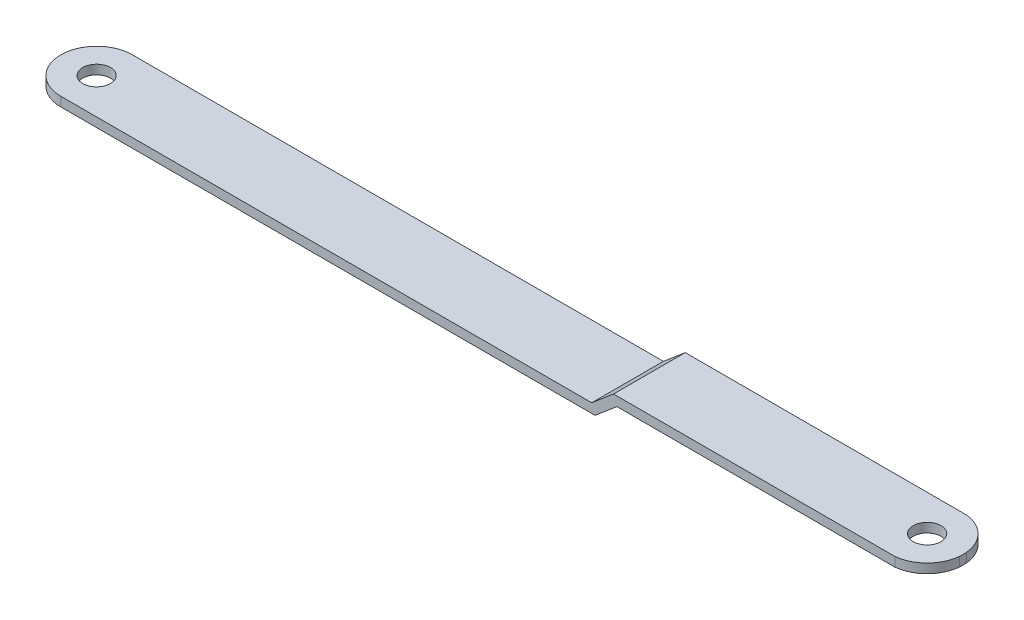
ISO-10303-21;
HEADER;
FILE_DESCRIPTION(('STEP AP214'),'2;1');
FILE_NAME('part.step','',(''),(''),'','','');
FILE_SCHEMA(('AUTOMOTIVE_DESIGN { 1 0 10303 214 1 1 1 1 }'));
ENDSEC;
DATA;
#1=APPLICATION_CONTEXT('core data for automotive mechanical design processes');
#2=APPLICATION_PROTOCOL_DEFINITION('international standard','automotive_design',2000,#1);
#3=PRODUCT_CONTEXT('',#1,'mechanical');
#4=PRODUCT('Part','Part','',(#3));
#5=PRODUCT_RELATED_PRODUCT_CATEGORY('part','',(#4));
#6=PRODUCT_DEFINITION_FORMATION('','',#4);
#7=PRODUCT_DEFINITION_CONTEXT('part definition',#1,'design');
#8=PRODUCT_DEFINITION('design','',#6,#7);
#9=PRODUCT_DEFINITION_SHAPE('','',#8);
#10=(LENGTH_UNIT() NAMED_UNIT(*) SI_UNIT(.MILLI.,.METRE.));
#11=(NAMED_UNIT(*) PLANE_ANGLE_UNIT() SI_UNIT($,.RADIAN.));
#12=(NAMED_UNIT(*) SI_UNIT($,.STERADIAN.) SOLID_ANGLE_UNIT());
#13=UNCERTAINTY_MEASURE_WITH_UNIT(LENGTH_MEASURE(1.E-05),#10,'distance_accuracy_value','');
#14=(GEOMETRIC_REPRESENTATION_CONTEXT(3) GLOBAL_UNCERTAINTY_ASSIGNED_CONTEXT((#13)) GLOBAL_UNIT_ASSIGNED_CONTEXT((#10,
#11,#12)) REPRESENTATION_CONTEXT('',''));
#15=CARTESIAN_POINT('',(0.,0.,0.));
#16=DIRECTION('',(0.,0.,1.));
#17=DIRECTION('',(1.,0.,0.));
#18=AXIS2_PLACEMENT_3D('',#15,#16,#17);
#19=CARTESIAN_POINT('',(127.21941338225,2.,15.5));
#20=DIRECTION('',(0.,1.,0.));
#21=DIRECTION('',(0.,0.,1.));
#22=AXIS2_PLACEMENT_3D('',#19,#20,#21);
#23=PLANE('',#22);
#24=CARTESIAN_POINT('',(187.25,2.,7.75));
#25=DIRECTION('',(0.,1.,0.));
#26=DIRECTION('',(0.,0.,1.));
#27=AXIS2_PLACEMENT_3D('',#24,#25,#26);
#28=CIRCLE('',#27,2.99999999999999);
#29=CARTESIAN_POINT('',(187.25,2.,10.75));
#30=VERTEX_POINT('',#29);
#31=EDGE_CURVE('E147',#30,#30,#28,.T.);
#32=ORIENTED_EDGE('',*,*,#31,.T.);
#33=EDGE_LOOP('',(#32));
#34=FACE_BOUND('',#33,.T.);
#35=CARTESIAN_POINT('',(187.25,2.,7.75));
#36=DIRECTION('',(0.,1.,0.));
#37=DIRECTION('',(0.,0.,1.));
#38=AXIS2_PLACEMENT_3D('',#35,#36,#37);
#39=CIRCLE('',#38,7.7884174595187);
#40=CARTESIAN_POINT('',(188.022623144706,2.,15.5));
#41=VERTEX_POINT('',#40);
#42=CARTESIAN_POINT('',(195.,2.,8.52262314470612));
#43=VERTEX_POINT('',#42);
#44=EDGE_CURVE('E227',#41,#43,#39,.T.);
#45=ORIENTED_EDGE('',*,*,#44,.F.);
#46=DIRECTION('',(1.,0.,0.));
#47=VECTOR('',#46,1.);
#48=CARTESIAN_POINT('',(127.21941338225,2.,15.5));
#49=LINE('',#48,#47);
#50=CARTESIAN_POINT('',(127.952959941045,2.,15.5));
#51=VERTEX_POINT('',#50);
#52=EDGE_CURVE('E159',#51,#41,#49,.T.);
#53=ORIENTED_EDGE('',*,*,#52,.F.);
#54=DIRECTION('',(0.,0.,-1.));
#55=VECTOR('',#54,1.);
#56=CARTESIAN_POINT('',(127.952959941045,2.,15.5));
#57=LINE('',#56,#55);
#58=CARTESIAN_POINT('',(127.952959941045,2.,0.));
#59=VERTEX_POINT('',#58);
#60=EDGE_CURVE('E160',#51,#59,#57,.T.);
#61=ORIENTED_EDGE('',*,*,#60,.T.);
#62=DIRECTION('',(1.,0.,0.));
#63=VECTOR('',#62,1.);
#64=CARTESIAN_POINT('',(127.21941338225,2.,0.));
#65=LINE('',#64,#63);
#66=CARTESIAN_POINT('',(188.022623144706,2.,0.));
#67=VERTEX_POINT('',#66);
#68=EDGE_CURVE('E141',#59,#67,#65,.T.);
#69=ORIENTED_EDGE('',*,*,#68,.T.);
#70=CARTESIAN_POINT('',(195.,2.,6.97737685529388));
#71=VERTEX_POINT('',#70);
#72=EDGE_CURVE('E121',#71,#67,#39,.T.);
#73=ORIENTED_EDGE('',*,*,#72,.F.);
#74=DIRECTION('',(0.,0.,-1.));
#75=VECTOR('',#74,1.);
#76=CARTESIAN_POINT('',(195.,2.,15.5));
#77=LINE('',#76,#75);
#78=EDGE_CURVE('E178',#43,#71,#77,.T.);
#79=ORIENTED_EDGE('',*,*,#78,.F.);
#80=EDGE_LOOP('',(#45,#53,#61,#69,#73,#79));
#81=FACE_BOUND('',#80,.T.);
#82=ADVANCED_FACE('F40',(#34,#81),#23,.F.);
#83=CARTESIAN_POINT('',(195.,4.,15.5));
#84=DIRECTION('',(1.,0.,0.));
#85=DIRECTION('',(0.,0.,-1.));
#86=AXIS2_PLACEMENT_3D('',#83,#84,#85);
#87=PLANE('',#86);
#88=ORIENTED_EDGE('',*,*,#78,.T.);
#89=DIRECTION('',(0.,1.,0.));
#90=VECTOR('',#89,1.);
#91=CARTESIAN_POINT('',(195.,-6.,6.97737685529388));
#92=LINE('',#91,#90);
#93=CARTESIAN_POINT('',(195.,4.,6.97737685529388));
#94=VERTEX_POINT('',#93);
#95=EDGE_CURVE('E230',#71,#94,#92,.T.);
#96=ORIENTED_EDGE('',*,*,#95,.T.);
#97=DIRECTION('',(0.,0.,-1.));
#98=VECTOR('',#97,1.);
#99=CARTESIAN_POINT('',(195.,4.,15.5));
#100=LINE('',#99,#98);
#101=CARTESIAN_POINT('',(195.,4.,8.52262314470612));
#102=VERTEX_POINT('',#101);
#103=EDGE_CURVE('E134',#102,#94,#100,.T.);
#104=ORIENTED_EDGE('',*,*,#103,.F.);
#105=DIRECTION('',(0.,1.,0.));
#106=VECTOR('',#105,1.);
#107=CARTESIAN_POINT('',(195.,-6.,8.52262314470612));
#108=LINE('',#107,#106);
#109=EDGE_CURVE('E231',#102,#43,#108,.F.);
#110=ORIENTED_EDGE('',*,*,#109,.T.);
#111=EDGE_LOOP('',(#88,#96,#104,#110));
#112=FACE_BOUND('',#111,.T.);
#113=ADVANCED_FACE('F266',(#112),#87,.T.);
#114=CARTESIAN_POINT('',(127.21941338225,4.,15.5));
#115=DIRECTION('',(0.,1.,0.));
#116=DIRECTION('',(0.,0.,1.));
#117=AXIS2_PLACEMENT_3D('',#114,#115,#116);
#118=PLANE('',#117);
#119=CARTESIAN_POINT('',(187.25,4.,7.75));
#120=DIRECTION('',(0.,1.,0.));
#121=DIRECTION('',(0.,0.,1.));
#122=AXIS2_PLACEMENT_3D('',#119,#120,#121);
#123=CIRCLE('',#122,2.99999999999999);
#124=CARTESIAN_POINT('',(187.25,4.,10.75));
#125=VERTEX_POINT('',#124);
#126=EDGE_CURVE('E376',#125,#125,#123,.T.);
#127=ORIENTED_EDGE('',*,*,#126,.F.);
#128=EDGE_LOOP('',(#127));
#129=FACE_BOUND('',#128,.T.);
#130=DIRECTION('',(1.,0.,0.));
#131=VECTOR('',#130,1.);
#132=CARTESIAN_POINT('',(127.21941338225,4.,15.5));
#133=LINE('',#132,#131);
#134=CARTESIAN_POINT('',(127.21941338225,4.,15.5));
#135=VERTEX_POINT('',#134);
#136=CARTESIAN_POINT('',(188.022623144706,4.,15.5));
#137=VERTEX_POINT('',#136);
#138=EDGE_CURVE('E198',#135,#137,#133,.T.);
#139=ORIENTED_EDGE('',*,*,#138,.T.);
#140=CARTESIAN_POINT('',(187.25,4.,7.75));
#141=DIRECTION('',(0.,1.,0.));
#142=DIRECTION('',(0.,0.,-1.));
#143=AXIS2_PLACEMENT_3D('',#140,#141,#142);
#144=CIRCLE('',#143,7.7884174595187);
#145=EDGE_CURVE('E56',#137,#102,#144,.T.);
#146=ORIENTED_EDGE('',*,*,#145,.T.);
#147=ORIENTED_EDGE('',*,*,#103,.T.);
#148=CARTESIAN_POINT('',(188.022623144706,4.,0.));
#149=VERTEX_POINT('',#148);
#150=EDGE_CURVE('E118',#94,#149,#144,.T.);
#151=ORIENTED_EDGE('',*,*,#150,.T.);
#152=DIRECTION('',(1.,0.,0.));
#153=VECTOR('',#152,1.);
#154=CARTESIAN_POINT('',(127.21941338225,4.,0.));
#155=LINE('',#154,#153);
#156=CARTESIAN_POINT('',(127.21941338225,4.,0.));
#157=VERTEX_POINT('',#156);
#158=EDGE_CURVE('E131',#157,#149,#155,.T.);
#159=ORIENTED_EDGE('',*,*,#158,.F.);
#160=DIRECTION('',(0.,0.,-1.));
#161=VECTOR('',#160,1.);
#162=CARTESIAN_POINT('',(127.21941338225,4.,15.5));
#163=LINE('',#162,#161);
#164=EDGE_CURVE('E173',#135,#157,#163,.T.);
#165=ORIENTED_EDGE('',*,*,#164,.F.);
#166=EDGE_LOOP('',(#139,#146,#147,#151,#159,#165));
#167=FACE_BOUND('',#166,.T.);
#168=ADVANCED_FACE('F130',(#129,#167),#118,.T.);
#169=CARTESIAN_POINT('',(0.,0.,15.5));
#170=DIRECTION('',(0.,1.,0.));
#171=DIRECTION('',(0.,0.,1.));
#172=AXIS2_PLACEMENT_3D('',#169,#170,#171);
#173=PLANE('',#172);
#174=CARTESIAN_POINT('',(7.75,0.,7.75));
#175=DIRECTION('',(0.,1.,0.));
#176=DIRECTION('',(0.,0.,1.));
#177=AXIS2_PLACEMENT_3D('',#174,#175,#176);
#178=CIRCLE('',#177,3.);
#179=CARTESIAN_POINT('',(7.75,0.,10.75));
#180=VERTEX_POINT('',#179);
#181=EDGE_CURVE('E240',#180,#180,#178,.T.);
#182=ORIENTED_EDGE('',*,*,#181,.F.);
#183=EDGE_LOOP('',(#182));
#184=FACE_BOUND('',#183,.T.);
#185=DIRECTION('',(1.,0.,0.));
#186=VECTOR('',#185,1.);
#187=CARTESIAN_POINT('',(0.,0.,0.));
#188=LINE('',#187,#186);
#189=CARTESIAN_POINT('',(7.75,0.,0.));
#190=VERTEX_POINT('',#189);
#191=CARTESIAN_POINT('',(122.5,0.,0.));
#192=VERTEX_POINT('',#191);
#193=EDGE_CURVE('E145',#190,#192,#188,.T.);
#194=ORIENTED_EDGE('',*,*,#193,.F.);
#195=CARTESIAN_POINT('',(7.75,0.,7.75));
#196=DIRECTION('',(0.,1.,0.));
#197=DIRECTION('',(0.,0.,1.));
#198=AXIS2_PLACEMENT_3D('',#195,#196,#197);
#199=CIRCLE('',#198,7.75);
#200=CARTESIAN_POINT('',(7.75,0.,15.5));
#201=VERTEX_POINT('',#200);
#202=EDGE_CURVE('E64',#190,#201,#199,.T.);
#203=ORIENTED_EDGE('',*,*,#202,.T.);
#204=DIRECTION('',(1.,0.,0.));
#205=VECTOR('',#204,1.);
#206=CARTESIAN_POINT('',(0.,0.,15.5));
#207=LINE('',#206,#205);
#208=CARTESIAN_POINT('',(122.5,0.,15.5));
#209=VERTEX_POINT('',#208);
#210=EDGE_CURVE('E191',#201,#209,#207,.T.);
#211=ORIENTED_EDGE('',*,*,#210,.T.);
#212=DIRECTION('',(0.,0.,-1.));
#213=VECTOR('',#212,1.);
#214=CARTESIAN_POINT('',(122.5,0.,15.5));
#215=LINE('',#214,#213);
#216=EDGE_CURVE('E169',#209,#192,#215,.T.);
#217=ORIENTED_EDGE('',*,*,#216,.T.);
#218=EDGE_LOOP('',(#194,#203,#211,#217));
#219=FACE_BOUND('',#218,.T.);
#220=ADVANCED_FACE('F188',(#184,#219),#173,.T.);
#221=CARTESIAN_POINT('',(0.,-2.,15.5));
#222=DIRECTION('',(0.,1.,0.));
#223=DIRECTION('',(0.,0.,1.));
#224=AXIS2_PLACEMENT_3D('',#221,#222,#223);
#225=PLANE('',#224);
#226=CARTESIAN_POINT('',(7.75,-2.,7.75));
#227=DIRECTION('',(0.,1.,0.));
#228=DIRECTION('',(0.,0.,1.));
#229=AXIS2_PLACEMENT_3D('',#226,#227,#228);
#230=CIRCLE('',#229,3.);
#231=CARTESIAN_POINT('',(7.75,-2.,10.75));
#232=VERTEX_POINT('',#231);
#233=EDGE_CURVE('E43',#232,#232,#230,.T.);
#234=ORIENTED_EDGE('',*,*,#233,.T.);
#235=EDGE_LOOP('',(#234));
#236=FACE_BOUND('',#235,.T.);
#237=CARTESIAN_POINT('',(7.75,-2.,7.75));
#238=DIRECTION('',(0.,1.,0.));
#239=DIRECTION('',(0.,0.,1.));
#240=AXIS2_PLACEMENT_3D('',#237,#238,#239);
#241=CIRCLE('',#240,7.75);
#242=CARTESIAN_POINT('',(7.75,-2.,0.));
#243=VERTEX_POINT('',#242);
#244=CARTESIAN_POINT('',(7.75,-2.,15.5));
#245=VERTEX_POINT('',#244);
#246=EDGE_CURVE('E374',#243,#245,#241,.T.);
#247=ORIENTED_EDGE('',*,*,#246,.F.);
#248=DIRECTION('',(1.,0.,0.));
#249=VECTOR('',#248,1.);
#250=CARTESIAN_POINT('',(0.,-2.,0.));
#251=LINE('',#250,#249);
#252=CARTESIAN_POINT('',(123.233546558795,-2.,0.));
#253=VERTEX_POINT('',#252);
#254=EDGE_CURVE('E153',#243,#253,#251,.T.);
#255=ORIENTED_EDGE('',*,*,#254,.T.);
#256=DIRECTION('',(0.,0.,-1.));
#257=VECTOR('',#256,1.);
#258=CARTESIAN_POINT('',(123.233546558795,-2.,15.5));
#259=LINE('',#258,#257);
#260=CARTESIAN_POINT('',(123.233546558795,-2.,15.5));
#261=VERTEX_POINT('',#260);
#262=EDGE_CURVE('E164',#261,#253,#259,.T.);
#263=ORIENTED_EDGE('',*,*,#262,.F.);
#264=DIRECTION('',(1.,0.,0.));
#265=VECTOR('',#264,1.);
#266=CARTESIAN_POINT('',(0.,-2.,15.5));
#267=LINE('',#266,#265);
#268=EDGE_CURVE('E213',#245,#261,#267,.T.);
#269=ORIENTED_EDGE('',*,*,#268,.F.);
#270=EDGE_LOOP('',(#247,#255,#263,#269));
#271=FACE_BOUND('',#270,.T.);
#272=ADVANCED_FACE('F281',(#236,#271),#225,.F.);
#273=CARTESIAN_POINT('',(0.,0.,15.5));
#274=DIRECTION('',(0.,0.,-1.));
#275=DIRECTION('',(-1.,0.,0.));
#276=AXIS2_PLACEMENT_3D('',#273,#274,#275);
#277=PLANE('',#276);
#278=DIRECTION('',(0.,1.,0.));
#279=VECTOR('',#278,1.);
#280=CARTESIAN_POINT('',(188.022623144706,-6.,15.5));
#281=LINE('',#280,#279);
#282=EDGE_CURVE('E202',#41,#137,#281,.T.);
#283=ORIENTED_EDGE('',*,*,#282,.T.);
#284=ORIENTED_EDGE('',*,*,#138,.F.);
#285=DIRECTION('',(0.762855964407713,0.646568463171209,0.));
#286=VECTOR('',#285,1.);
#287=CARTESIAN_POINT('',(122.5,0.,15.5));
#288=LINE('',#287,#286);
#289=EDGE_CURVE('E196',#209,#135,#288,.T.);
#290=ORIENTED_EDGE('',*,*,#289,.F.);
#291=ORIENTED_EDGE('',*,*,#210,.F.);
#292=DIRECTION('',(0.,1.,0.));
#293=VECTOR('',#292,1.);
#294=CARTESIAN_POINT('',(7.75,-6.,15.5));
#295=LINE('',#294,#293);
#296=EDGE_CURVE('E383',#245,#201,#295,.T.);
#297=ORIENTED_EDGE('',*,*,#296,.F.);
#298=ORIENTED_EDGE('',*,*,#268,.T.);
#299=DIRECTION('',(0.762855964407713,0.646568463171209,0.));
#300=VECTOR('',#299,1.);
#301=CARTESIAN_POINT('',(123.793136926342,-1.52571192881543,15.5));
#302=LINE('',#301,#300);
#303=EDGE_CURVE('E165',#261,#51,#302,.T.);
#304=ORIENTED_EDGE('',*,*,#303,.T.);
#305=ORIENTED_EDGE('',*,*,#52,.T.);
#306=EDGE_LOOP('',(#283,#284,#290,#291,#297,#298,#304,#305));
#307=FACE_BOUND('',#306,.T.);
#308=ADVANCED_FACE('F200',(#307),#277,.F.);
#309=CARTESIAN_POINT('',(0.,0.,0.));
#310=DIRECTION('',(0.,0.,-1.));
#311=DIRECTION('',(-1.,0.,0.));
#312=AXIS2_PLACEMENT_3D('',#309,#310,#311);
#313=PLANE('',#312);
#314=ORIENTED_EDGE('',*,*,#158,.T.);
#315=DIRECTION('',(0.,1.,0.));
#316=VECTOR('',#315,1.);
#317=CARTESIAN_POINT('',(188.022623144706,-6.,0.));
#318=LINE('',#317,#316);
#319=EDGE_CURVE('E12',#149,#67,#318,.F.);
#320=ORIENTED_EDGE('',*,*,#319,.T.);
#321=ORIENTED_EDGE('',*,*,#68,.F.);
#322=DIRECTION('',(0.762855964407713,0.646568463171209,0.));
#323=VECTOR('',#322,1.);
#324=CARTESIAN_POINT('',(123.793136926342,-1.52571192881543,0.));
#325=LINE('',#324,#323);
#326=EDGE_CURVE('E156',#253,#59,#325,.T.);
#327=ORIENTED_EDGE('',*,*,#326,.F.);
#328=ORIENTED_EDGE('',*,*,#254,.F.);
#329=DIRECTION('',(0.,1.,0.));
#330=VECTOR('',#329,1.);
#331=CARTESIAN_POINT('',(7.75,-6.,0.));
#332=LINE('',#331,#330);
#333=EDGE_CURVE('E49',#243,#190,#332,.T.);
#334=ORIENTED_EDGE('',*,*,#333,.T.);
#335=ORIENTED_EDGE('',*,*,#193,.T.);
#336=DIRECTION('',(0.762855964407713,0.646568463171209,0.));
#337=VECTOR('',#336,1.);
#338=CARTESIAN_POINT('',(122.5,0.,0.));
#339=LINE('',#338,#337);
#340=EDGE_CURVE('E139',#192,#157,#339,.T.);
#341=ORIENTED_EDGE('',*,*,#340,.T.);
#342=EDGE_LOOP('',(#314,#320,#321,#327,#328,#334,#335,#341));
#343=FACE_BOUND('',#342,.T.);
#344=ADVANCED_FACE('F137',(#343),#313,.T.);
#345=CARTESIAN_POINT('',(122.5,0.,15.5));
#346=DIRECTION('',(-0.646568463171209,0.762855964407713,0.));
#347=DIRECTION('',(-0.762855964407713,-0.646568463171209,0.));
#348=AXIS2_PLACEMENT_3D('',#345,#346,#347);
#349=PLANE('',#348);
#350=ORIENTED_EDGE('',*,*,#340,.F.);
#351=ORIENTED_EDGE('',*,*,#216,.F.);
#352=ORIENTED_EDGE('',*,*,#289,.T.);
#353=ORIENTED_EDGE('',*,*,#164,.T.);
#354=EDGE_LOOP('',(#350,#351,#352,#353));
#355=FACE_BOUND('',#354,.T.);
#356=ADVANCED_FACE('F195',(#355),#349,.T.);
#357=CARTESIAN_POINT('',(123.793136926342,-1.52571192881543,15.5));
#358=DIRECTION('',(-0.646568463171209,0.762855964407713,0.));
#359=DIRECTION('',(-0.762855964407713,-0.646568463171209,0.));
#360=AXIS2_PLACEMENT_3D('',#357,#358,#359);
#361=PLANE('',#360);
#362=ORIENTED_EDGE('',*,*,#326,.T.);
#363=ORIENTED_EDGE('',*,*,#60,.F.);
#364=ORIENTED_EDGE('',*,*,#303,.F.);
#365=ORIENTED_EDGE('',*,*,#262,.T.);
#366=EDGE_LOOP('',(#362,#363,#364,#365));
#367=FACE_BOUND('',#366,.T.);
#368=ADVANCED_FACE('F223',(#367),#361,.F.);
#369=CARTESIAN_POINT('',(7.75,-6.,7.75));
#370=DIRECTION('',(0.,1.,0.));
#371=DIRECTION('',(0.,0.,1.));
#372=AXIS2_PLACEMENT_3D('',#369,#370,#371);
#373=CYLINDRICAL_SURFACE('',#372,7.75);
#374=ORIENTED_EDGE('',*,*,#333,.F.);
#375=ORIENTED_EDGE('',*,*,#246,.T.);
#376=ORIENTED_EDGE('',*,*,#296,.T.);
#377=ORIENTED_EDGE('',*,*,#202,.F.);
#378=EDGE_LOOP('',(#374,#375,#376,#377));
#379=FACE_BOUND('',#378,.T.);
#380=ADVANCED_FACE('F287',(#379),#373,.T.);
#381=CARTESIAN_POINT('',(187.25,-6.,7.75));
#382=DIRECTION('',(0.,1.,0.));
#383=DIRECTION('',(0.,0.,1.));
#384=AXIS2_PLACEMENT_3D('',#381,#382,#383);
#385=CYLINDRICAL_SURFACE('',#384,7.7884174595187);
#386=ORIENTED_EDGE('',*,*,#72,.T.);
#387=ORIENTED_EDGE('',*,*,#319,.F.);
#388=ORIENTED_EDGE('',*,*,#150,.F.);
#389=ORIENTED_EDGE('',*,*,#95,.F.);
#390=EDGE_LOOP('',(#386,#387,#388,#389));
#391=FACE_BOUND('',#390,.T.);
#392=ADVANCED_FACE('F117',(#391),#385,.T.);
#393=ORIENTED_EDGE('',*,*,#44,.T.);
#394=ORIENTED_EDGE('',*,*,#109,.F.);
#395=ORIENTED_EDGE('',*,*,#145,.F.);
#396=ORIENTED_EDGE('',*,*,#282,.F.);
#397=EDGE_LOOP('',(#393,#394,#395,#396));
#398=FACE_BOUND('',#397,.T.);
#399=ADVANCED_FACE('F261',(#398),#385,.T.);
#400=CARTESIAN_POINT('',(7.75,-6.,7.75));
#401=DIRECTION('',(0.,1.,0.));
#402=DIRECTION('',(0.,0.,1.));
#403=AXIS2_PLACEMENT_3D('',#400,#401,#402);
#404=CYLINDRICAL_SURFACE('',#403,3.);
#405=ORIENTED_EDGE('',*,*,#181,.T.);
#406=EDGE_LOOP('',(#405));
#407=FACE_BOUND('',#406,.T.);
#408=ORIENTED_EDGE('',*,*,#233,.F.);
#409=EDGE_LOOP('',(#408));
#410=FACE_BOUND('',#409,.T.);
#411=ADVANCED_FACE('F255',(#407,#410),#404,.F.);
#412=CARTESIAN_POINT('',(187.25,-6.,7.75));
#413=DIRECTION('',(0.,1.,0.));
#414=DIRECTION('',(0.,0.,1.));
#415=AXIS2_PLACEMENT_3D('',#412,#413,#414);
#416=CYLINDRICAL_SURFACE('',#415,2.99999999999999);
#417=ORIENTED_EDGE('',*,*,#126,.T.);
#418=EDGE_LOOP('',(#417));
#419=FACE_BOUND('',#418,.T.);
#420=ORIENTED_EDGE('',*,*,#31,.F.);
#421=EDGE_LOOP('',(#420));
#422=FACE_BOUND('',#421,.T.);
#423=ADVANCED_FACE('F253',(#419,#422),#416,.F.);
#424=CLOSED_SHELL('',(#82,#113,#168,#220,#272,#308,#344,#356,#368,#380,#392,#399,#411,#423));
#425=MANIFOLD_SOLID_BREP('B2',#424);
#426=ADVANCED_BREP_SHAPE_REPRESENTATION('',(#18,#425),#14);
#427=SHAPE_DEFINITION_REPRESENTATION(#9,#426);
ENDSEC;
END-ISO-10303-21;
